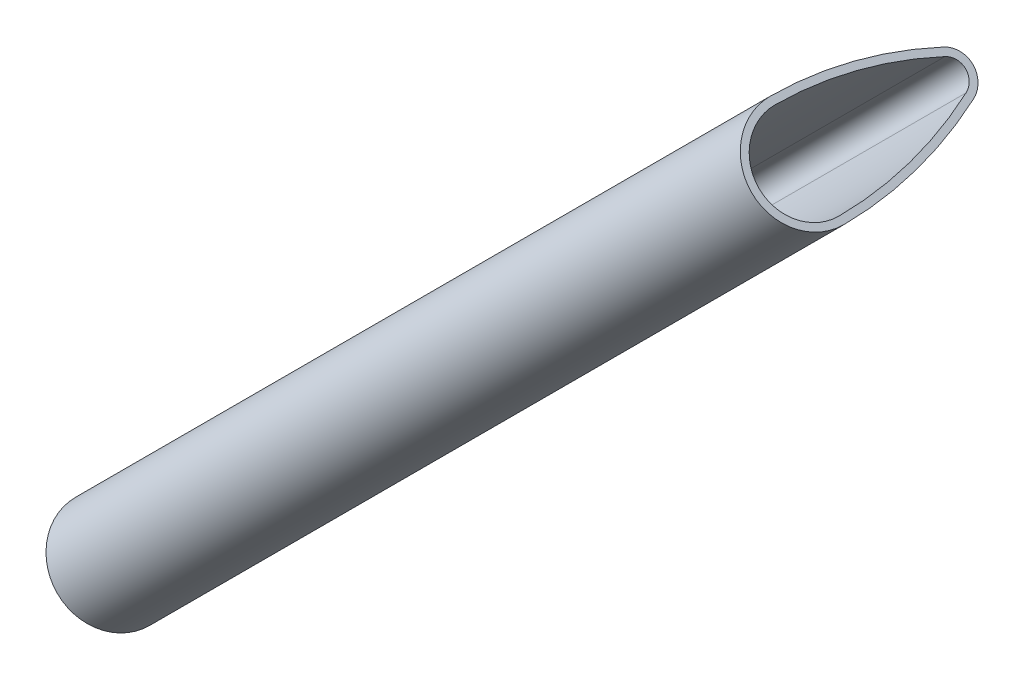
ISO-10303-21;
HEADER;
FILE_DESCRIPTION(('STEP AP214'),'2;1');
FILE_NAME('part.step','',(''),(''),'','','');
FILE_SCHEMA(('AUTOMOTIVE_DESIGN { 1 0 10303 214 1 1 1 1 }'));
ENDSEC;
DATA;
#1=APPLICATION_CONTEXT('core data for automotive mechanical design processes');
#2=APPLICATION_PROTOCOL_DEFINITION('international standard','automotive_design',2000,#1);
#3=PRODUCT_CONTEXT('',#1,'mechanical');
#4=PRODUCT('Part','Part','',(#3));
#5=PRODUCT_RELATED_PRODUCT_CATEGORY('part','',(#4));
#6=PRODUCT_DEFINITION_FORMATION('','',#4);
#7=PRODUCT_DEFINITION_CONTEXT('part definition',#1,'design');
#8=PRODUCT_DEFINITION('design','',#6,#7);
#9=PRODUCT_DEFINITION_SHAPE('','',#8);
#10=(LENGTH_UNIT() NAMED_UNIT(*) SI_UNIT(.MILLI.,.METRE.));
#11=(NAMED_UNIT(*) PLANE_ANGLE_UNIT() SI_UNIT($,.RADIAN.));
#12=(NAMED_UNIT(*) SI_UNIT($,.STERADIAN.) SOLID_ANGLE_UNIT());
#13=UNCERTAINTY_MEASURE_WITH_UNIT(LENGTH_MEASURE(1.E-05),#10,'distance_accuracy_value','');
#14=(GEOMETRIC_REPRESENTATION_CONTEXT(3) GLOBAL_UNCERTAINTY_ASSIGNED_CONTEXT((#13)) GLOBAL_UNIT_ASSIGNED_CONTEXT((#10,
#11,#12)) REPRESENTATION_CONTEXT('',''));
#15=CARTESIAN_POINT('',(0.,0.,0.));
#16=DIRECTION('',(0.,0.,1.));
#17=DIRECTION('',(1.,0.,0.));
#18=AXIS2_PLACEMENT_3D('',#15,#16,#17);
#19=CARTESIAN_POINT('',(102.39353564593,102.393535637071,-7.01603729119519));
#20=DIRECTION('',(-0.70441602640276,-0.70441602640276,-0.087155742747645));
#21=DIRECTION('',(0.707106781186548,-0.707106781186548,0.));
#22=AXIS2_PLACEMENT_3D('',#19,#20,#21);
#23=CYLINDRICAL_SURFACE('',#22,4.50000528391474);
#24=CARTESIAN_POINT('',(34.294678891979,34.2946788831206,-15.4417491123265));
#25=DIRECTION('',(-0.70441602640276,-0.70441602640276,-0.087155742747645));
#26=DIRECTION('',(-0.707106781186548,0.707106781186548,0.));
#27=AXIS2_PLACEMENT_3D('',#24,#25,#26);
#28=CIRCLE('',#27,4.50000528391474);
#29=CARTESIAN_POINT('',(37.4769099088875,31.1129439421092,-15.4457585304235));
#30=VERTEX_POINT('',#29);
#31=CARTESIAN_POINT('',(31.1129445017894,37.4769104396485,-15.4457673436614));
#32=VERTEX_POINT('',#31);
#33=EDGE_CURVE('E132',#30,#32,#28,.T.);
#34=ORIENTED_EDGE('',*,*,#33,.F.);
#35=DIRECTION('',(-0.70441602640276,-0.70441602640276,-0.087155742747645));
#36=VECTOR('',#35,1.);
#37=CARTESIAN_POINT('',(105.575766662838,99.21180069606,-7.02004670929225));
#38=LINE('',#37,#36);
#39=CARTESIAN_POINT('',(105.575766662838,99.21180069606,-7.02004670929225));
#40=VERTEX_POINT('',#39);
#41=EDGE_CURVE('E11',#40,#30,#38,.T.);
#42=ORIENTED_EDGE('',*,*,#41,.F.);
#43=CARTESIAN_POINT('',(102.39353564593,102.393535637071,-7.01603729119519));
#44=DIRECTION('',(-0.70441602640276,-0.70441602640276,-0.087155742747645));
#45=DIRECTION('',(-0.707106781186548,0.707106781186548,0.));
#46=AXIS2_PLACEMENT_3D('',#43,#44,#45);
#47=CIRCLE('',#46,4.50000528391474);
#48=CARTESIAN_POINT('',(99.2118012557402,105.575767193599,-7.0200555225301));
#49=VERTEX_POINT('',#48);
#50=EDGE_CURVE('E136',#40,#49,#47,.T.);
#51=ORIENTED_EDGE('',*,*,#50,.T.);
#52=DIRECTION('',(-0.70441602640276,-0.70441602640276,-0.087155742747645));
#53=VECTOR('',#52,1.);
#54=CARTESIAN_POINT('',(99.2118012557402,105.575767193599,-7.0200555225301));
#55=LINE('',#54,#53);
#56=EDGE_CURVE('E37',#49,#32,#55,.T.);
#57=ORIENTED_EDGE('',*,*,#56,.T.);
#58=EDGE_LOOP('',(#34,#42,#51,#57));
#59=FACE_BOUND('',#58,.T.);
#60=ADVANCED_FACE('F34',(#59),#23,.T.);
#61=CARTESIAN_POINT('',(84.3583524481818,120.420680345682,-6.95106807175082));
#62=DIRECTION('',(-0.70441602640276,-0.70441602640276,-0.087155742747645));
#63=DIRECTION('',(0.707106781186548,-0.707106781186548,0.));
#64=AXIS2_PLACEMENT_3D('',#61,#62,#63);
#65=CYLINDRICAL_SURFACE('',#64,30.0000000000148);
#66=CARTESIAN_POINT('',(16.2594956942311,52.3218235917312,-15.3767798928821));
#67=DIRECTION('',(-0.70441602640276,-0.70441602640276,-0.087155742747645));
#68=DIRECTION('',(-0.707106781186548,0.707106781186548,0.));
#69=AXIS2_PLACEMENT_3D('',#66,#67,#68);
#70=CIRCLE('',#69,30.0000000000148);
#71=CARTESIAN_POINT('',(36.3422342750981,33.7664084696945,-27.7210166348737));
#72=VERTEX_POINT('',#71);
#73=EDGE_CURVE('E140',#72,#30,#70,.T.);
#74=ORIENTED_EDGE('',*,*,#73,.F.);
#75=DIRECTION('',(-0.70441602640276,-0.70441602640276,-0.087155742747645));
#76=VECTOR('',#75,1.);
#77=CARTESIAN_POINT('',(104.441091029049,101.865265223645,-19.2953048137424));
#78=LINE('',#77,#76);
#79=CARTESIAN_POINT('',(104.441091029049,101.865265223645,-19.2953048137424));
#80=VERTEX_POINT('',#79);
#81=EDGE_CURVE('E42',#80,#72,#78,.T.);
#82=ORIENTED_EDGE('',*,*,#81,.F.);
#83=CARTESIAN_POINT('',(84.3583524481818,120.420680345682,-6.95106807175082));
#84=DIRECTION('',(-0.70441602640276,-0.70441602640276,-0.087155742747645));
#85=DIRECTION('',(-0.707106781186548,0.707106781186548,0.));
#86=AXIS2_PLACEMENT_3D('',#83,#84,#85);
#87=CIRCLE('',#86,30.0000000000148);
#88=EDGE_CURVE('E146',#80,#40,#87,.T.);
#89=ORIENTED_EDGE('',*,*,#88,.T.);
#90=ORIENTED_EDGE('',*,*,#41,.T.);
#91=EDGE_LOOP('',(#74,#82,#89,#90));
#92=FACE_BOUND('',#91,.T.);
#93=ADVANCED_FACE('F172',(#92),#65,.T.);
#94=CARTESIAN_POINT('',(103.102268353127,103.102268355787,-18.472372024941));
#95=DIRECTION('',(-0.70441602640276,-0.70441602640276,-0.087155742747645));
#96=DIRECTION('',(0.707106781186548,-0.707106781186548,0.));
#97=AXIS2_PLACEMENT_3D('',#94,#95,#96);
#98=CYLINDRICAL_SURFACE('',#97,1.99996031995019);
#99=CARTESIAN_POINT('',(35.0034115991766,35.0034116018365,-26.8980838460723));
#100=DIRECTION('',(-0.70441602640276,-0.70441602640276,-0.087155742747645));
#101=DIRECTION('',(0.707106781186548,-0.707106781186548,0.));
#102=AXIS2_PLACEMENT_3D('',#99,#100,#101);
#103=CIRCLE('',#102,1.99996031995019);
#104=CARTESIAN_POINT('',(33.7664141637215,36.3422304175625,-27.721031477888));
#105=VERTEX_POINT('',#104);
#106=EDGE_CURVE('E154',#105,#72,#103,.T.);
#107=ORIENTED_EDGE('',*,*,#106,.F.);
#108=DIRECTION('',(-0.70441602640276,-0.70441602640276,-0.087155742747645));
#109=VECTOR('',#108,1.);
#110=CARTESIAN_POINT('',(101.865270917672,104.441087171513,-19.2953196567567));
#111=LINE('',#110,#109);
#112=CARTESIAN_POINT('',(101.865270917672,104.441087171513,-19.2953196567567));
#113=VERTEX_POINT('',#112);
#114=EDGE_CURVE('E159',#113,#105,#111,.T.);
#115=ORIENTED_EDGE('',*,*,#114,.F.);
#116=CARTESIAN_POINT('',(103.102268353127,103.102268355787,-18.472372024941));
#117=DIRECTION('',(-0.70441602640276,-0.70441602640276,-0.087155742747645));
#118=DIRECTION('',(0.707106781186548,-0.707106781186548,0.));
#119=AXIS2_PLACEMENT_3D('',#116,#117,#118);
#120=CIRCLE('',#119,1.99996031995019);
#121=EDGE_CURVE('E143',#113,#80,#120,.T.);
#122=ORIENTED_EDGE('',*,*,#121,.T.);
#123=ORIENTED_EDGE('',*,*,#81,.T.);
#124=EDGE_LOOP('',(#107,#115,#122,#123));
#125=FACE_BOUND('',#124,.T.);
#126=ADVANCED_FACE('F176',(#125),#98,.T.);
#127=CARTESIAN_POINT('',(120.419941545151,84.3591197852761,-6.95129871188879));
#128=DIRECTION('',(-0.70441602640276,-0.70441602640276,-0.087155742747645));
#129=DIRECTION('',(0.707106781186548,-0.707106781186548,0.));
#130=AXIS2_PLACEMENT_3D('',#127,#128,#129);
#131=CYLINDRICAL_SURFACE('',#130,29.9989344691349);
#132=CARTESIAN_POINT('',(52.3210847912002,16.2602630313253,-15.3770105330201));
#133=DIRECTION('',(-0.70441602640276,-0.70441602640276,-0.087155742747645));
#134=DIRECTION('',(0.707106781186548,-0.707106781186548,0.));
#135=AXIS2_PLACEMENT_3D('',#132,#133,#134);
#136=CIRCLE('',#135,29.9989344691349);
#137=EDGE_CURVE('E151',#32,#105,#136,.T.);
#138=ORIENTED_EDGE('',*,*,#137,.F.);
#139=ORIENTED_EDGE('',*,*,#56,.F.);
#140=CARTESIAN_POINT('',(120.419941545151,84.3591197852761,-6.95129871188879));
#141=DIRECTION('',(-0.70441602640276,-0.70441602640276,-0.087155742747645));
#142=DIRECTION('',(0.707106781186548,-0.707106781186548,0.));
#143=AXIS2_PLACEMENT_3D('',#140,#141,#142);
#144=CIRCLE('',#143,29.9989344691349);
#145=EDGE_CURVE('E139',#49,#113,#144,.T.);
#146=ORIENTED_EDGE('',*,*,#145,.T.);
#147=ORIENTED_EDGE('',*,*,#114,.T.);
#148=EDGE_LOOP('',(#138,#139,#146,#147));
#149=FACE_BOUND('',#148,.T.);
#150=ADVANCED_FACE('F167',(#149),#131,.T.);
#151=CARTESIAN_POINT('',(93.3759440470558,111.407107991377,-6.98355268147301));
#152=DIRECTION('',(0.70441602640276,0.70441602640276,0.087155742747645));
#153=DIRECTION('',(-0.707106781186548,0.707106781186548,0.));
#154=AXIS2_PLACEMENT_3D('',#151,#152,#153);
#155=PLANE('',#154);
#156=CARTESIAN_POINT('',(84.3591078379687,120.419953048393,-6.95129512283214));
#157=DIRECTION('',(-0.70441602640276,-0.70441602640276,-0.087155742747645));
#158=DIRECTION('',(-0.707106781186548,0.707106781186548,0.));
#159=AXIS2_PLACEMENT_3D('',#156,#157,#158);
#160=CIRCLE('',#159,29.3989510544848);
#161=CARTESIAN_POINT('',(104.039438563561,102.23637012257,-19.0484112095296));
#162=VERTEX_POINT('',#161);
#163=CARTESIAN_POINT('',(105.151457750662,99.6360198138824,-7.01932096730851));
#164=VERTEX_POINT('',#163);
#165=EDGE_CURVE('E101',#162,#164,#160,.T.);
#166=ORIENTED_EDGE('',*,*,#165,.T.);
#167=CARTESIAN_POINT('',(102.393515201644,102.393512126677,-7.01568203771609));
#168=DIRECTION('',(-0.70441602640276,-0.70441602640276,-0.087155742747645));
#169=DIRECTION('',(-0.707106781186548,0.707106781186548,0.));
#170=AXIS2_PLACEMENT_3D('',#167,#168,#169);
#171=CIRCLE('',#170,3.90000310264169);
#172=CARTESIAN_POINT('',(99.6364146449865,105.151831133101,-7.02552987465139));
#173=VERTEX_POINT('',#172);
#174=EDGE_CURVE('E110',#164,#173,#171,.T.);
#175=ORIENTED_EDGE('',*,*,#174,.T.);
#176=CARTESIAN_POINT('',(120.419953572156,84.359107304031,-6.95129504059758));
#177=DIRECTION('',(-0.70441602640276,-0.70441602640276,-0.087155742747645));
#178=DIRECTION('',(-0.707106781186548,0.707106781186548,0.));
#179=AXIS2_PLACEMENT_3D('',#176,#177,#178);
#180=CIRCLE('',#179,29.3989517734855);
#181=CARTESIAN_POINT('',(102.236370115536,104.039438569273,-19.0484111988485));
#182=VERTEX_POINT('',#181);
#183=EDGE_CURVE('E50',#173,#182,#180,.T.);
#184=ORIENTED_EDGE('',*,*,#183,.T.);
#185=CARTESIAN_POINT('',(103.102266996353,103.102266999287,-18.4723500955299));
#186=DIRECTION('',(-0.70441602640276,-0.70441602640276,-0.087155742747645));
#187=DIRECTION('',(-0.707106781186548,0.707106781186548,0.));
#188=AXIS2_PLACEMENT_3D('',#185,#186,#187);
#189=CIRCLE('',#188,1.39996941200666);
#190=EDGE_CURVE('E107',#182,#162,#189,.T.);
#191=ORIENTED_EDGE('',*,*,#190,.T.);
#192=EDGE_LOOP('',(#166,#175,#184,#191));
#193=FACE_BOUND('',#192,.T.);
#194=ORIENTED_EDGE('',*,*,#50,.F.);
#195=ORIENTED_EDGE('',*,*,#88,.F.);
#196=ORIENTED_EDGE('',*,*,#121,.F.);
#197=ORIENTED_EDGE('',*,*,#145,.F.);
#198=EDGE_LOOP('',(#194,#195,#196,#197));
#199=FACE_BOUND('',#198,.T.);
#200=ADVANCED_FACE('F114',(#193,#199),#155,.T.);
#201=CARTESIAN_POINT('',(25.277087293105,43.3082512374259,-15.4092645026043));
#202=DIRECTION('',(0.70441602640276,0.70441602640276,0.087155742747645));
#203=DIRECTION('',(-0.707106781186548,0.707106781186548,0.));
#204=AXIS2_PLACEMENT_3D('',#201,#202,#203);
#205=PLANE('',#204);
#206=CARTESIAN_POINT('',(34.2946584476935,34.2946553727263,-15.4413938588474));
#207=DIRECTION('',(-0.70441602640276,-0.70441602640276,-0.087155742747645));
#208=DIRECTION('',(-0.707106781186548,0.707106781186548,0.));
#209=AXIS2_PLACEMENT_3D('',#206,#207,#208);
#210=CIRCLE('',#209,3.90000310264169);
#211=CARTESIAN_POINT('',(37.0526009967116,31.5371630599316,-15.4450327884398));
#212=VERTEX_POINT('',#211);
#213=CARTESIAN_POINT('',(31.5375578910357,37.0529743791502,-15.4512416957827));
#214=VERTEX_POINT('',#213);
#215=EDGE_CURVE('E126',#212,#214,#210,.T.);
#216=ORIENTED_EDGE('',*,*,#215,.F.);
#217=CARTESIAN_POINT('',(16.260251084018,52.321096294442,-15.3770069439634));
#218=DIRECTION('',(-0.70441602640276,-0.70441602640276,-0.087155742747645));
#219=DIRECTION('',(-0.707106781186548,0.707106781186548,0.));
#220=AXIS2_PLACEMENT_3D('',#217,#218,#219);
#221=CIRCLE('',#220,29.3989510544848);
#222=CARTESIAN_POINT('',(35.9405818096101,34.1375133686192,-27.4741230306609));
#223=VERTEX_POINT('',#222);
#224=EDGE_CURVE('E58',#223,#212,#221,.T.);
#225=ORIENTED_EDGE('',*,*,#224,.F.);
#226=CARTESIAN_POINT('',(35.0034102424021,35.0034102453364,-26.8980619166612));
#227=DIRECTION('',(-0.70441602640276,-0.70441602640276,-0.087155742747645));
#228=DIRECTION('',(-0.707106781186548,0.707106781186548,0.));
#229=AXIS2_PLACEMENT_3D('',#226,#227,#228);
#230=CIRCLE('',#229,1.39996941200666);
#231=CARTESIAN_POINT('',(34.1375133615855,35.9405818153223,-27.4741230199797));
#232=VERTEX_POINT('',#231);
#233=EDGE_CURVE('E117',#232,#223,#230,.T.);
#234=ORIENTED_EDGE('',*,*,#233,.F.);
#235=CARTESIAN_POINT('',(52.321096818205,16.2602505500803,-15.3770068617289));
#236=DIRECTION('',(-0.70441602640276,-0.70441602640276,-0.087155742747645));
#237=DIRECTION('',(-0.707106781186548,0.707106781186548,0.));
#238=AXIS2_PLACEMENT_3D('',#235,#236,#237);
#239=CIRCLE('',#238,29.3989517734855);
#240=EDGE_CURVE('E120',#214,#232,#239,.T.);
#241=ORIENTED_EDGE('',*,*,#240,.F.);
#242=EDGE_LOOP('',(#216,#225,#234,#241));
#243=FACE_BOUND('',#242,.T.);
#244=ORIENTED_EDGE('',*,*,#33,.T.);
#245=ORIENTED_EDGE('',*,*,#137,.T.);
#246=ORIENTED_EDGE('',*,*,#106,.T.);
#247=ORIENTED_EDGE('',*,*,#73,.T.);
#248=EDGE_LOOP('',(#244,#245,#246,#247));
#249=FACE_BOUND('',#248,.T.);
#250=ADVANCED_FACE('F169',(#243,#249),#205,.F.);
#251=CARTESIAN_POINT('',(84.3591078379687,120.419953048393,-6.95129512283214));
#252=DIRECTION('',(-0.70441602640276,-0.70441602640276,-0.087155742747645));
#253=DIRECTION('',(0.707106781186548,-0.707106781186548,0.));
#254=AXIS2_PLACEMENT_3D('',#251,#252,#253);
#255=CYLINDRICAL_SURFACE('',#254,29.3989510544848);
#256=ORIENTED_EDGE('',*,*,#224,.T.);
#257=DIRECTION('',(-0.70441602640276,-0.70441602640276,-0.087155742747645));
#258=VECTOR('',#257,1.);
#259=CARTESIAN_POINT('',(105.151457750662,99.6360198138824,-7.01932096730851));
#260=LINE('',#259,#258);
#261=EDGE_CURVE('E97',#164,#212,#260,.T.);
#262=ORIENTED_EDGE('',*,*,#261,.F.);
#263=ORIENTED_EDGE('',*,*,#165,.F.);
#264=DIRECTION('',(-0.70441602640276,-0.70441602640276,-0.087155742747645));
#265=VECTOR('',#264,1.);
#266=CARTESIAN_POINT('',(104.039438563561,102.23637012257,-19.0484112095296));
#267=LINE('',#266,#265);
#268=EDGE_CURVE('E130',#162,#223,#267,.T.);
#269=ORIENTED_EDGE('',*,*,#268,.T.);
#270=EDGE_LOOP('',(#256,#262,#263,#269));
#271=FACE_BOUND('',#270,.T.);
#272=ADVANCED_FACE('F99',(#271),#255,.F.);
#273=CARTESIAN_POINT('',(103.102266996353,103.102266999287,-18.4723500955299));
#274=DIRECTION('',(-0.70441602640276,-0.70441602640276,-0.087155742747645));
#275=DIRECTION('',(0.707106781186548,-0.707106781186548,0.));
#276=AXIS2_PLACEMENT_3D('',#273,#274,#275);
#277=CYLINDRICAL_SURFACE('',#276,1.39996941200666);
#278=ORIENTED_EDGE('',*,*,#233,.T.);
#279=ORIENTED_EDGE('',*,*,#268,.F.);
#280=ORIENTED_EDGE('',*,*,#190,.F.);
#281=DIRECTION('',(-0.70441602640276,-0.70441602640276,-0.087155742747645));
#282=VECTOR('',#281,1.);
#283=CARTESIAN_POINT('',(102.236370115536,104.039438569273,-19.0484111988485));
#284=LINE('',#283,#282);
#285=EDGE_CURVE('E133',#182,#232,#284,.T.);
#286=ORIENTED_EDGE('',*,*,#285,.T.);
#287=EDGE_LOOP('',(#278,#279,#280,#286));
#288=FACE_BOUND('',#287,.T.);
#289=ADVANCED_FACE('F227',(#288),#277,.F.);
#290=CARTESIAN_POINT('',(120.419953572156,84.359107304031,-6.95129504059758));
#291=DIRECTION('',(-0.70441602640276,-0.70441602640276,-0.087155742747645));
#292=DIRECTION('',(0.707106781186548,-0.707106781186548,0.));
#293=AXIS2_PLACEMENT_3D('',#290,#291,#292);
#294=CYLINDRICAL_SURFACE('',#293,29.3989517734855);
#295=ORIENTED_EDGE('',*,*,#240,.T.);
#296=ORIENTED_EDGE('',*,*,#285,.F.);
#297=ORIENTED_EDGE('',*,*,#183,.F.);
#298=DIRECTION('',(-0.70441602640276,-0.70441602640276,-0.087155742747645));
#299=VECTOR('',#298,1.);
#300=CARTESIAN_POINT('',(99.6364146449865,105.151831133101,-7.02552987465139));
#301=LINE('',#300,#299);
#302=EDGE_CURVE('E106',#173,#214,#301,.T.);
#303=ORIENTED_EDGE('',*,*,#302,.T.);
#304=EDGE_LOOP('',(#295,#296,#297,#303));
#305=FACE_BOUND('',#304,.T.);
#306=ADVANCED_FACE('F236',(#305),#294,.F.);
#307=CARTESIAN_POINT('',(102.393515201644,102.393512126677,-7.01568203771609));
#308=DIRECTION('',(-0.70441602640276,-0.70441602640276,-0.087155742747645));
#309=DIRECTION('',(0.707106781186548,-0.707106781186548,0.));
#310=AXIS2_PLACEMENT_3D('',#307,#308,#309);
#311=CYLINDRICAL_SURFACE('',#310,3.90000310264169);
#312=ORIENTED_EDGE('',*,*,#215,.T.);
#313=ORIENTED_EDGE('',*,*,#302,.F.);
#314=ORIENTED_EDGE('',*,*,#174,.F.);
#315=ORIENTED_EDGE('',*,*,#261,.T.);
#316=EDGE_LOOP('',(#312,#313,#314,#315));
#317=FACE_BOUND('',#316,.T.);
#318=ADVANCED_FACE('F111',(#317),#311,.F.);
#319=CLOSED_SHELL('',(#60,#93,#126,#150,#200,#250,#272,#289,#306,#318));
#320=MANIFOLD_SOLID_BREP('B2',#319);
#321=ADVANCED_BREP_SHAPE_REPRESENTATION('',(#18,#320),#14);
#322=SHAPE_DEFINITION_REPRESENTATION(#9,#321);
ENDSEC;
END-ISO-10303-21;
